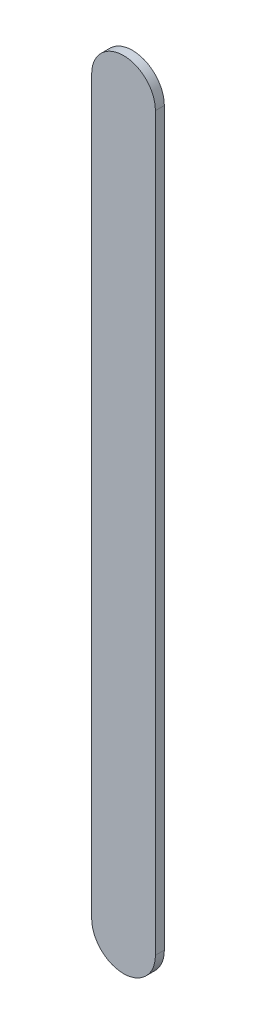
ISO-10303-21;
HEADER;
FILE_DESCRIPTION(('STEP AP214'),'2;1');
FILE_NAME('part.step','',(''),(''),'','','');
FILE_SCHEMA(('AUTOMOTIVE_DESIGN { 1 0 10303 214 1 1 1 1 }'));
ENDSEC;
DATA;
#1=APPLICATION_CONTEXT('core data for automotive mechanical design processes');
#2=APPLICATION_PROTOCOL_DEFINITION('international standard','automotive_design',2000,#1);
#3=PRODUCT_CONTEXT('',#1,'mechanical');
#4=PRODUCT('Part','Part','',(#3));
#5=PRODUCT_RELATED_PRODUCT_CATEGORY('part','',(#4));
#6=PRODUCT_DEFINITION_FORMATION('','',#4);
#7=PRODUCT_DEFINITION_CONTEXT('part definition',#1,'design');
#8=PRODUCT_DEFINITION('design','',#6,#7);
#9=PRODUCT_DEFINITION_SHAPE('','',#8);
#10=(LENGTH_UNIT() NAMED_UNIT(*) SI_UNIT(.MILLI.,.METRE.));
#11=(NAMED_UNIT(*) PLANE_ANGLE_UNIT() SI_UNIT($,.RADIAN.));
#12=(NAMED_UNIT(*) SI_UNIT($,.STERADIAN.) SOLID_ANGLE_UNIT());
#13=UNCERTAINTY_MEASURE_WITH_UNIT(LENGTH_MEASURE(1.E-05),#10,'distance_accuracy_value','');
#14=(GEOMETRIC_REPRESENTATION_CONTEXT(3) GLOBAL_UNCERTAINTY_ASSIGNED_CONTEXT((#13)) GLOBAL_UNIT_ASSIGNED_CONTEXT((#10,
#11,#12)) REPRESENTATION_CONTEXT('',''));
#15=CARTESIAN_POINT('',(0.,0.,0.));
#16=DIRECTION('',(0.,0.,1.));
#17=DIRECTION('',(1.,0.,0.));
#18=AXIS2_PLACEMENT_3D('',#15,#16,#17);
#19=CARTESIAN_POINT('',(90.9189952,72.6619959,0.));
#20=DIRECTION('',(-1.,0.,0.));
#21=DIRECTION('',(0.,1.,0.));
#22=AXIS2_PLACEMENT_3D('',#19,#20,#21);
#23=PLANE('',#22);
#24=DIRECTION('',(0.,1.,0.));
#25=VECTOR('',#24,1.);
#26=CARTESIAN_POINT('',(90.9189952,72.6619959,0.03556));
#27=LINE('',#26,#25);
#28=CARTESIAN_POINT('',(90.9189952,72.6619959,0.03556));
#29=VERTEX_POINT('',#28);
#30=CARTESIAN_POINT('',(90.9189952,75.5780048,0.03556));
#31=VERTEX_POINT('',#30);
#32=EDGE_CURVE('E11',#29,#31,#27,.T.);
#33=ORIENTED_EDGE('',*,*,#32,.F.);
#34=DIRECTION('',(0.,0.,1.));
#35=VECTOR('',#34,1.);
#36=CARTESIAN_POINT('',(90.9189952,72.6619959,0.));
#37=LINE('',#36,#35);
#38=CARTESIAN_POINT('',(90.9189952,72.6619959,0.));
#39=VERTEX_POINT('',#38);
#40=EDGE_CURVE('E24',#39,#29,#37,.T.);
#41=ORIENTED_EDGE('',*,*,#40,.F.);
#42=DIRECTION('',(0.,1.,0.));
#43=VECTOR('',#42,1.);
#44=CARTESIAN_POINT('',(90.9189952,72.6619959,0.));
#45=LINE('',#44,#43);
#46=CARTESIAN_POINT('',(90.9189952,75.5780048,0.));
#47=VERTEX_POINT('',#46);
#48=EDGE_CURVE('E75',#39,#47,#45,.T.);
#49=ORIENTED_EDGE('',*,*,#48,.T.);
#50=DIRECTION('',(0.,0.,1.));
#51=VECTOR('',#50,1.);
#52=CARTESIAN_POINT('',(90.9189952,75.5780048,0.));
#53=LINE('',#52,#51);
#54=EDGE_CURVE('E37',#47,#31,#53,.T.);
#55=ORIENTED_EDGE('',*,*,#54,.T.);
#56=EDGE_LOOP('',(#33,#41,#49,#55));
#57=FACE_BOUND('',#56,.T.);
#58=ADVANCED_FACE('F17',(#57),#23,.F.);
#59=CARTESIAN_POINT('',(90.7919952,75.5780048,0.));
#60=DIRECTION('',(0.,0.,-1.));
#61=DIRECTION('',(1.,0.,0.));
#62=AXIS2_PLACEMENT_3D('',#59,#60,#61);
#63=CYLINDRICAL_SURFACE('',#62,0.127);
#64=CARTESIAN_POINT('',(90.7919952,75.5780048,0.03556));
#65=DIRECTION('',(0.,0.,1.));
#66=DIRECTION('',(1.,0.,0.));
#67=AXIS2_PLACEMENT_3D('',#64,#65,#66);
#68=CIRCLE('',#67,0.127);
#69=CARTESIAN_POINT('',(90.6649952,75.5780048,0.03556));
#70=VERTEX_POINT('',#69);
#71=EDGE_CURVE('E83',#31,#70,#68,.T.);
#72=ORIENTED_EDGE('',*,*,#71,.F.);
#73=ORIENTED_EDGE('',*,*,#54,.F.);
#74=CARTESIAN_POINT('',(90.7919952,75.5780048,0.));
#75=DIRECTION('',(0.,0.,1.));
#76=DIRECTION('',(1.,0.,0.));
#77=AXIS2_PLACEMENT_3D('',#74,#75,#76);
#78=CIRCLE('',#77,0.127);
#79=CARTESIAN_POINT('',(90.6649952,75.5780048,0.));
#80=VERTEX_POINT('',#79);
#81=EDGE_CURVE('E81',#47,#80,#78,.T.);
#82=ORIENTED_EDGE('',*,*,#81,.T.);
#83=DIRECTION('',(0.,0.,1.));
#84=VECTOR('',#83,1.);
#85=CARTESIAN_POINT('',(90.6649952,75.5780048,0.));
#86=LINE('',#85,#84);
#87=EDGE_CURVE('E67',#80,#70,#86,.T.);
#88=ORIENTED_EDGE('',*,*,#87,.T.);
#89=EDGE_LOOP('',(#72,#73,#82,#88));
#90=FACE_BOUND('',#89,.T.);
#91=ADVANCED_FACE('F89',(#90),#63,.T.);
#92=CARTESIAN_POINT('',(90.6649952,75.5780048,0.));
#93=DIRECTION('',(1.,0.,0.));
#94=DIRECTION('',(0.,-1.,0.));
#95=AXIS2_PLACEMENT_3D('',#92,#93,#94);
#96=PLANE('',#95);
#97=DIRECTION('',(0.,-1.,0.));
#98=VECTOR('',#97,1.);
#99=CARTESIAN_POINT('',(90.6649952,75.5780048,0.03556));
#100=LINE('',#99,#98);
#101=CARTESIAN_POINT('',(90.6649952,72.6619959,0.03556));
#102=VERTEX_POINT('',#101);
#103=EDGE_CURVE('E71',#70,#102,#100,.T.);
#104=ORIENTED_EDGE('',*,*,#103,.F.);
#105=ORIENTED_EDGE('',*,*,#87,.F.);
#106=DIRECTION('',(0.,-1.,0.));
#107=VECTOR('',#106,1.);
#108=CARTESIAN_POINT('',(90.6649952,75.5780048,0.));
#109=LINE('',#108,#107);
#110=CARTESIAN_POINT('',(90.6649952,72.6619959,0.));
#111=VERTEX_POINT('',#110);
#112=EDGE_CURVE('E63',#80,#111,#109,.T.);
#113=ORIENTED_EDGE('',*,*,#112,.T.);
#114=DIRECTION('',(0.,0.,1.));
#115=VECTOR('',#114,1.);
#116=CARTESIAN_POINT('',(90.6649952,72.6619959,0.));
#117=LINE('',#116,#115);
#118=EDGE_CURVE('E53',#111,#102,#117,.T.);
#119=ORIENTED_EDGE('',*,*,#118,.T.);
#120=EDGE_LOOP('',(#104,#105,#113,#119));
#121=FACE_BOUND('',#120,.T.);
#122=ADVANCED_FACE('F66',(#121),#96,.F.);
#123=CARTESIAN_POINT('',(90.7919952,72.6619959,0.));
#124=DIRECTION('',(0.,0.,-1.));
#125=DIRECTION('',(-1.,0.,0.));
#126=AXIS2_PLACEMENT_3D('',#123,#124,#125);
#127=CYLINDRICAL_SURFACE('',#126,0.127);
#128=CARTESIAN_POINT('',(90.7919952,72.6619959,0.03556));
#129=DIRECTION('',(0.,0.,1.));
#130=DIRECTION('',(-1.,0.,0.));
#131=AXIS2_PLACEMENT_3D('',#128,#129,#130);
#132=CIRCLE('',#131,0.127);
#133=EDGE_CURVE('E59',#102,#29,#132,.T.);
#134=ORIENTED_EDGE('',*,*,#133,.F.);
#135=ORIENTED_EDGE('',*,*,#118,.F.);
#136=CARTESIAN_POINT('',(90.7919952,72.6619959,0.));
#137=DIRECTION('',(0.,0.,1.));
#138=DIRECTION('',(-1.,0.,0.));
#139=AXIS2_PLACEMENT_3D('',#136,#137,#138);
#140=CIRCLE('',#139,0.127);
#141=EDGE_CURVE('E57',#111,#39,#140,.T.);
#142=ORIENTED_EDGE('',*,*,#141,.T.);
#143=ORIENTED_EDGE('',*,*,#40,.T.);
#144=EDGE_LOOP('',(#134,#135,#142,#143));
#145=FACE_BOUND('',#144,.T.);
#146=ADVANCED_FACE('F55',(#145),#127,.T.);
#147=CARTESIAN_POINT('',(90.9189952,72.6619959,0.));
#148=DIRECTION('',(0.,0.,-1.));
#149=DIRECTION('',(-1.,0.,0.));
#150=AXIS2_PLACEMENT_3D('',#147,#148,#149);
#151=PLANE('',#150);
#152=ORIENTED_EDGE('',*,*,#141,.F.);
#153=ORIENTED_EDGE('',*,*,#112,.F.);
#154=ORIENTED_EDGE('',*,*,#81,.F.);
#155=ORIENTED_EDGE('',*,*,#48,.F.);
#156=EDGE_LOOP('',(#152,#153,#154,#155));
#157=FACE_BOUND('',#156,.T.);
#158=ADVANCED_FACE('F74',(#157),#151,.T.);
#159=CARTESIAN_POINT('',(90.9189952,72.6619959,0.03556));
#160=DIRECTION('',(0.,0.,-1.));
#161=DIRECTION('',(-1.,0.,0.));
#162=AXIS2_PLACEMENT_3D('',#159,#160,#161);
#163=PLANE('',#162);
#164=ORIENTED_EDGE('',*,*,#32,.T.);
#165=ORIENTED_EDGE('',*,*,#71,.T.);
#166=ORIENTED_EDGE('',*,*,#103,.T.);
#167=ORIENTED_EDGE('',*,*,#133,.T.);
#168=EDGE_LOOP('',(#164,#165,#166,#167));
#169=FACE_BOUND('',#168,.T.);
#170=ADVANCED_FACE('F91',(#169),#163,.F.);
#171=CLOSED_SHELL('',(#58,#91,#122,#146,#158,#170));
#172=MANIFOLD_SOLID_BREP('B1',#171);
#173=ADVANCED_BREP_SHAPE_REPRESENTATION('',(#18,#172),#14);
#174=SHAPE_DEFINITION_REPRESENTATION(#9,#173);
ENDSEC;
END-ISO-10303-21;
